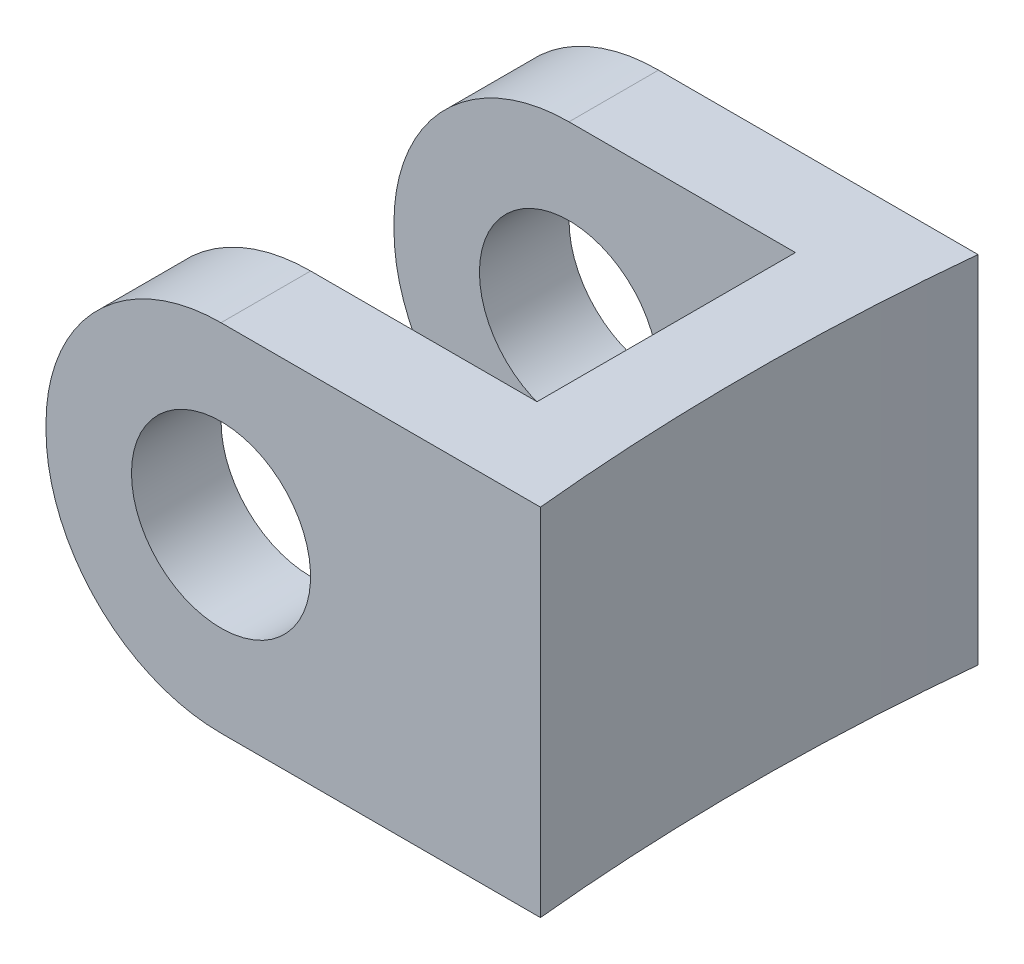
ISO-10303-21;
HEADER;
FILE_DESCRIPTION(('STEP AP214'),'2;1');
FILE_NAME('part.step','',(''),(''),'','','');
FILE_SCHEMA(('AUTOMOTIVE_DESIGN { 1 0 10303 214 1 1 1 1 }'));
ENDSEC;
DATA;
#1=APPLICATION_CONTEXT('core data for automotive mechanical design processes');
#2=APPLICATION_PROTOCOL_DEFINITION('international standard','automotive_design',2000,#1);
#3=PRODUCT_CONTEXT('',#1,'mechanical');
#4=PRODUCT('Part','Part','',(#3));
#5=PRODUCT_RELATED_PRODUCT_CATEGORY('part','',(#4));
#6=PRODUCT_DEFINITION_FORMATION('','',#4);
#7=PRODUCT_DEFINITION_CONTEXT('part definition',#1,'design');
#8=PRODUCT_DEFINITION('design','',#6,#7);
#9=PRODUCT_DEFINITION_SHAPE('','',#8);
#10=(LENGTH_UNIT() NAMED_UNIT(*) SI_UNIT(.MILLI.,.METRE.));
#11=(NAMED_UNIT(*) PLANE_ANGLE_UNIT() SI_UNIT($,.RADIAN.));
#12=(NAMED_UNIT(*) SI_UNIT($,.STERADIAN.) SOLID_ANGLE_UNIT());
#13=UNCERTAINTY_MEASURE_WITH_UNIT(LENGTH_MEASURE(1.E-05),#10,'distance_accuracy_value','');
#14=(GEOMETRIC_REPRESENTATION_CONTEXT(3) GLOBAL_UNCERTAINTY_ASSIGNED_CONTEXT((#13)) GLOBAL_UNIT_ASSIGNED_CONTEXT((#10,
#11,#12)) REPRESENTATION_CONTEXT('',''));
#15=CARTESIAN_POINT('',(0.,0.,0.));
#16=DIRECTION('',(0.,0.,1.));
#17=DIRECTION('',(1.,0.,0.));
#18=AXIS2_PLACEMENT_3D('',#15,#16,#17);
#19=CARTESIAN_POINT('',(0.,8.255,0.));
#20=DIRECTION('',(1.,0.,0.));
#21=DIRECTION('',(0.,0.,-1.));
#22=AXIS2_PLACEMENT_3D('',#19,#20,#21);
#23=PLANE('',#22);
#24=DIRECTION('',(0.,-1.,0.));
#25=VECTOR('',#24,1.);
#26=CARTESIAN_POINT('',(0.,8.255,0.));
#27=LINE('',#26,#25);
#28=CARTESIAN_POINT('',(0.,4.191,0.));
#29=VERTEX_POINT('',#28);
#30=CARTESIAN_POINT('',(0.,4.064,0.));
#31=VERTEX_POINT('',#30);
#32=EDGE_CURVE('E160',#29,#31,#27,.T.);
#33=ORIENTED_EDGE('',*,*,#32,.T.);
#34=DIRECTION('',(0.,0.,1.));
#35=VECTOR('',#34,1.);
#36=CARTESIAN_POINT('',(0.,4.064,0.));
#37=LINE('',#36,#35);
#38=CARTESIAN_POINT('',(0.,4.064,2.08026));
#39=VERTEX_POINT('',#38);
#40=EDGE_CURVE('E211',#31,#39,#37,.T.);
#41=ORIENTED_EDGE('',*,*,#40,.T.);
#42=DIRECTION('',(0.,-1.,0.));
#43=VECTOR('',#42,1.);
#44=CARTESIAN_POINT('',(0.,8.255,2.08026));
#45=LINE('',#44,#43);
#46=CARTESIAN_POINT('',(0.,4.191,2.08026));
#47=VERTEX_POINT('',#46);
#48=EDGE_CURVE('E143',#47,#39,#45,.T.);
#49=ORIENTED_EDGE('',*,*,#48,.F.);
#50=DIRECTION('',(0.,0.,1.));
#51=VECTOR('',#50,1.);
#52=CARTESIAN_POINT('',(0.,4.191,0.));
#53=LINE('',#52,#51);
#54=EDGE_CURVE('E53',#47,#29,#53,.F.);
#55=ORIENTED_EDGE('',*,*,#54,.T.);
#56=EDGE_LOOP('',(#33,#41,#49,#55));
#57=FACE_BOUND('',#56,.T.);
#58=ADVANCED_FACE('F33',(#57),#23,.F.);
#59=CARTESIAN_POINT('',(9.3218,8.255,2.08026));
#60=DIRECTION('',(0.,0.,-1.));
#61=DIRECTION('',(-1.,0.,0.));
#62=AXIS2_PLACEMENT_3D('',#59,#60,#61);
#63=PLANE('',#62);
#64=CARTESIAN_POINT('',(4.064,4.191,2.08026));
#65=DIRECTION('',(0.,0.,-1.));
#66=DIRECTION('',(-1.,0.,0.));
#67=AXIS2_PLACEMENT_3D('',#64,#65,#66);
#68=CIRCLE('',#67,2.07899);
#69=CARTESIAN_POINT('',(1.98501,4.191,2.08026));
#70=VERTEX_POINT('',#69);
#71=EDGE_CURVE('E163',#70,#70,#68,.T.);
#72=ORIENTED_EDGE('',*,*,#71,.T.);
#73=EDGE_LOOP('',(#72));
#74=FACE_BOUND('',#73,.T.);
#75=ORIENTED_EDGE('',*,*,#48,.T.);
#76=CARTESIAN_POINT('',(4.064,4.064,2.08026));
#77=DIRECTION('',(0.,0.,-1.));
#78=DIRECTION('',(-1.,0.,0.));
#79=AXIS2_PLACEMENT_3D('',#76,#77,#78);
#80=CIRCLE('',#79,4.064);
#81=CARTESIAN_POINT('',(4.064,0.,2.08026));
#82=VERTEX_POINT('',#81);
#83=EDGE_CURVE('E216',#39,#82,#80,.F.);
#84=ORIENTED_EDGE('',*,*,#83,.T.);
#85=DIRECTION('',(1.,0.,0.));
#86=VECTOR('',#85,1.);
#87=CARTESIAN_POINT('',(9.3218,0.,2.08026));
#88=LINE('',#87,#86);
#89=CARTESIAN_POINT('',(9.3218,0.,2.08026));
#90=VERTEX_POINT('',#89);
#91=EDGE_CURVE('E140',#82,#90,#88,.T.);
#92=ORIENTED_EDGE('',*,*,#91,.T.);
#93=DIRECTION('',(0.,-1.,0.));
#94=VECTOR('',#93,1.);
#95=CARTESIAN_POINT('',(9.3218,8.255,2.08026));
#96=LINE('',#95,#94);
#97=CARTESIAN_POINT('',(9.3218,8.255,2.08026));
#98=VERTEX_POINT('',#97);
#99=EDGE_CURVE('E136',#98,#90,#96,.T.);
#100=ORIENTED_EDGE('',*,*,#99,.F.);
#101=DIRECTION('',(1.,0.,0.));
#102=VECTOR('',#101,1.);
#103=CARTESIAN_POINT('',(9.3218,8.255,2.08026));
#104=LINE('',#103,#102);
#105=CARTESIAN_POINT('',(4.064,8.255,2.08026));
#106=VERTEX_POINT('',#105);
#107=EDGE_CURVE('E122',#106,#98,#104,.T.);
#108=ORIENTED_EDGE('',*,*,#107,.F.);
#109=CARTESIAN_POINT('',(4.064,4.191,2.08026));
#110=DIRECTION('',(0.,0.,-1.));
#111=DIRECTION('',(-1.,0.,0.));
#112=AXIS2_PLACEMENT_3D('',#109,#110,#111);
#113=CIRCLE('',#112,4.064);
#114=EDGE_CURVE('E214',#106,#47,#113,.F.);
#115=ORIENTED_EDGE('',*,*,#114,.T.);
#116=EDGE_LOOP('',(#75,#84,#92,#100,#108,#115));
#117=FACE_BOUND('',#116,.T.);
#118=ADVANCED_FACE('F138',(#74,#117),#63,.F.);
#119=CARTESIAN_POINT('',(9.3218,8.255,5.08));
#120=DIRECTION('',(1.,0.,0.));
#121=DIRECTION('',(0.,0.,-1.));
#122=AXIS2_PLACEMENT_3D('',#119,#120,#121);
#123=PLANE('',#122);
#124=DIRECTION('',(0.,0.,1.));
#125=VECTOR('',#124,1.);
#126=CARTESIAN_POINT('',(9.3218,0.,5.08));
#127=LINE('',#126,#125);
#128=CARTESIAN_POINT('',(9.3218,0.,8.07974));
#129=VERTEX_POINT('',#128);
#130=EDGE_CURVE('E162',#90,#129,#127,.T.);
#131=ORIENTED_EDGE('',*,*,#130,.T.);
#132=DIRECTION('',(0.,-1.,0.));
#133=VECTOR('',#132,1.);
#134=CARTESIAN_POINT('',(9.3218,8.255,8.07974));
#135=LINE('',#134,#133);
#136=CARTESIAN_POINT('',(9.3218,8.255,8.07974));
#137=VERTEX_POINT('',#136);
#138=EDGE_CURVE('E144',#137,#129,#135,.T.);
#139=ORIENTED_EDGE('',*,*,#138,.F.);
#140=DIRECTION('',(0.,0.,1.));
#141=VECTOR('',#140,1.);
#142=CARTESIAN_POINT('',(9.3218,8.255,5.08));
#143=LINE('',#142,#141);
#144=EDGE_CURVE('E127',#98,#137,#143,.T.);
#145=ORIENTED_EDGE('',*,*,#144,.F.);
#146=ORIENTED_EDGE('',*,*,#99,.T.);
#147=EDGE_LOOP('',(#131,#139,#145,#146));
#148=FACE_BOUND('',#147,.T.);
#149=ADVANCED_FACE('F146',(#148),#123,.F.);
#150=CARTESIAN_POINT('',(9.3218,8.255,8.07974));
#151=DIRECTION('',(0.,0.,1.));
#152=DIRECTION('',(1.,0.,0.));
#153=AXIS2_PLACEMENT_3D('',#150,#151,#152);
#154=PLANE('',#153);
#155=CARTESIAN_POINT('',(4.064,4.191,8.07974));
#156=DIRECTION('',(0.,0.,1.));
#157=DIRECTION('',(1.,0.,0.));
#158=AXIS2_PLACEMENT_3D('',#155,#156,#157);
#159=CIRCLE('',#158,2.07899);
#160=CARTESIAN_POINT('',(6.14299,4.191,8.07974));
#161=VERTEX_POINT('',#160);
#162=EDGE_CURVE('E400',#161,#161,#159,.T.);
#163=ORIENTED_EDGE('',*,*,#162,.T.);
#164=EDGE_LOOP('',(#163));
#165=FACE_BOUND('',#164,.T.);
#166=DIRECTION('',(-1.,0.,0.));
#167=VECTOR('',#166,1.);
#168=CARTESIAN_POINT('',(9.3218,0.,8.07974));
#169=LINE('',#168,#167);
#170=CARTESIAN_POINT('',(4.064,0.,8.07974));
#171=VERTEX_POINT('',#170);
#172=EDGE_CURVE('E165',#129,#171,#169,.T.);
#173=ORIENTED_EDGE('',*,*,#172,.T.);
#174=CARTESIAN_POINT('',(4.064,4.064,8.07974));
#175=DIRECTION('',(0.,0.,1.));
#176=DIRECTION('',(1.,0.,0.));
#177=AXIS2_PLACEMENT_3D('',#174,#175,#176);
#178=CIRCLE('',#177,4.064);
#179=CARTESIAN_POINT('',(0.,4.064,8.07974));
#180=VERTEX_POINT('',#179);
#181=EDGE_CURVE('E204',#171,#180,#178,.F.);
#182=ORIENTED_EDGE('',*,*,#181,.T.);
#183=DIRECTION('',(0.,-1.,0.));
#184=VECTOR('',#183,1.);
#185=CARTESIAN_POINT('',(0.,8.255,8.07974));
#186=LINE('',#185,#184);
#187=CARTESIAN_POINT('',(0.,4.191,8.07974));
#188=VERTEX_POINT('',#187);
#189=EDGE_CURVE('E184',#188,#180,#186,.T.);
#190=ORIENTED_EDGE('',*,*,#189,.F.);
#191=CARTESIAN_POINT('',(4.064,4.191,8.07974));
#192=DIRECTION('',(0.,0.,1.));
#193=DIRECTION('',(1.,0.,0.));
#194=AXIS2_PLACEMENT_3D('',#191,#192,#193);
#195=CIRCLE('',#194,4.064);
#196=CARTESIAN_POINT('',(4.064,8.255,8.07974));
#197=VERTEX_POINT('',#196);
#198=EDGE_CURVE('E202',#188,#197,#195,.F.);
#199=ORIENTED_EDGE('',*,*,#198,.T.);
#200=DIRECTION('',(-1.,0.,0.));
#201=VECTOR('',#200,1.);
#202=CARTESIAN_POINT('',(9.3218,8.255,8.07974));
#203=LINE('',#202,#201);
#204=EDGE_CURVE('E149',#137,#197,#203,.T.);
#205=ORIENTED_EDGE('',*,*,#204,.F.);
#206=ORIENTED_EDGE('',*,*,#138,.T.);
#207=EDGE_LOOP('',(#173,#182,#190,#199,#205,#206));
#208=FACE_BOUND('',#207,.T.);
#209=ADVANCED_FACE('F232',(#165,#208),#154,.F.);
#210=CARTESIAN_POINT('',(0.,8.255,8.07974));
#211=DIRECTION('',(1.,0.,0.));
#212=DIRECTION('',(0.,0.,-1.));
#213=AXIS2_PLACEMENT_3D('',#210,#211,#212);
#214=PLANE('',#213);
#215=ORIENTED_EDGE('',*,*,#189,.T.);
#216=DIRECTION('',(0.,0.,1.));
#217=VECTOR('',#216,1.);
#218=CARTESIAN_POINT('',(0.,4.064,8.07974));
#219=LINE('',#218,#217);
#220=CARTESIAN_POINT('',(0.,4.064,10.16));
#221=VERTEX_POINT('',#220);
#222=EDGE_CURVE('E191',#180,#221,#219,.T.);
#223=ORIENTED_EDGE('',*,*,#222,.T.);
#224=DIRECTION('',(0.,-1.,0.));
#225=VECTOR('',#224,1.);
#226=CARTESIAN_POINT('',(0.,8.255,10.16));
#227=LINE('',#226,#225);
#228=CARTESIAN_POINT('',(0.,4.191,10.16));
#229=VERTEX_POINT('',#228);
#230=EDGE_CURVE('E181',#229,#221,#227,.T.);
#231=ORIENTED_EDGE('',*,*,#230,.F.);
#232=DIRECTION('',(0.,0.,1.));
#233=VECTOR('',#232,1.);
#234=CARTESIAN_POINT('',(0.,4.191,8.07974));
#235=LINE('',#234,#233);
#236=EDGE_CURVE('E189',#229,#188,#235,.F.);
#237=ORIENTED_EDGE('',*,*,#236,.T.);
#238=EDGE_LOOP('',(#215,#223,#231,#237));
#239=FACE_BOUND('',#238,.T.);
#240=ADVANCED_FACE('F246',(#239),#214,.F.);
#241=CARTESIAN_POINT('',(11.2268,8.255,10.16));
#242=DIRECTION('',(0.,0.,-1.));
#243=DIRECTION('',(-1.,0.,0.));
#244=AXIS2_PLACEMENT_3D('',#241,#242,#243);
#245=PLANE('',#244);
#246=CARTESIAN_POINT('',(4.064,4.191,10.16));
#247=DIRECTION('',(0.,0.,-1.));
#248=DIRECTION('',(-1.,0.,0.));
#249=AXIS2_PLACEMENT_3D('',#246,#247,#248);
#250=CIRCLE('',#249,2.07899);
#251=CARTESIAN_POINT('',(1.98501,4.191,10.16));
#252=VERTEX_POINT('',#251);
#253=EDGE_CURVE('E402',#252,#252,#250,.T.);
#254=ORIENTED_EDGE('',*,*,#253,.T.);
#255=EDGE_LOOP('',(#254));
#256=FACE_BOUND('',#255,.T.);
#257=ORIENTED_EDGE('',*,*,#230,.T.);
#258=CARTESIAN_POINT('',(4.064,4.064,10.16));
#259=DIRECTION('',(0.,0.,-1.));
#260=DIRECTION('',(-1.,0.,0.));
#261=AXIS2_PLACEMENT_3D('',#258,#259,#260);
#262=CIRCLE('',#261,4.064);
#263=CARTESIAN_POINT('',(4.064,0.,10.16));
#264=VERTEX_POINT('',#263);
#265=EDGE_CURVE('E196',#221,#264,#262,.F.);
#266=ORIENTED_EDGE('',*,*,#265,.T.);
#267=DIRECTION('',(1.,0.,0.));
#268=VECTOR('',#267,1.);
#269=CARTESIAN_POINT('',(11.2268,0.,10.16));
#270=LINE('',#269,#268);
#271=CARTESIAN_POINT('',(11.4814381949837,0.,10.16));
#272=VERTEX_POINT('',#271);
#273=EDGE_CURVE('E168',#264,#272,#270,.T.);
#274=ORIENTED_EDGE('',*,*,#273,.T.);
#275=DIRECTION('',(0.,-1.,0.));
#276=VECTOR('',#275,1.);
#277=CARTESIAN_POINT('',(11.4814381949837,8.255,10.16));
#278=LINE('',#277,#276);
#279=CARTESIAN_POINT('',(11.4814381949837,8.255,10.16));
#280=VERTEX_POINT('',#279);
#281=EDGE_CURVE('E178',#280,#272,#278,.T.);
#282=ORIENTED_EDGE('',*,*,#281,.F.);
#283=DIRECTION('',(1.,0.,0.));
#284=VECTOR('',#283,1.);
#285=CARTESIAN_POINT('',(0.,8.255,10.16));
#286=LINE('',#285,#284);
#287=CARTESIAN_POINT('',(4.064,8.255,10.16));
#288=VERTEX_POINT('',#287);
#289=EDGE_CURVE('E151',#288,#280,#286,.T.);
#290=ORIENTED_EDGE('',*,*,#289,.F.);
#291=CARTESIAN_POINT('',(4.064,4.191,10.16));
#292=DIRECTION('',(0.,0.,-1.));
#293=DIRECTION('',(-1.,0.,0.));
#294=AXIS2_PLACEMENT_3D('',#291,#292,#293);
#295=CIRCLE('',#294,4.064);
#296=EDGE_CURVE('E194',#288,#229,#295,.F.);
#297=ORIENTED_EDGE('',*,*,#296,.T.);
#298=EDGE_LOOP('',(#257,#266,#274,#282,#290,#297));
#299=FACE_BOUND('',#298,.T.);
#300=ADVANCED_FACE('F243',(#256,#299),#245,.F.);
#301=CARTESIAN_POINT('',(62.0268,8.255,5.08));
#302=DIRECTION('',(0.,-1.,0.));
#303=DIRECTION('',(0.,0.,-1.));
#304=AXIS2_PLACEMENT_3D('',#301,#302,#303);
#305=CYLINDRICAL_SURFACE('',#304,50.8);
#306=CARTESIAN_POINT('',(62.0268,0.,5.08));
#307=DIRECTION('',(0.,-1.,0.));
#308=DIRECTION('',(0.,0.,1.));
#309=AXIS2_PLACEMENT_3D('',#306,#307,#308);
#310=CIRCLE('',#309,50.8);
#311=CARTESIAN_POINT('',(11.4814381949837,0.,0.));
#312=VERTEX_POINT('',#311);
#313=EDGE_CURVE('E170',#272,#312,#310,.T.);
#314=ORIENTED_EDGE('',*,*,#313,.T.);
#315=DIRECTION('',(0.,-1.,0.));
#316=VECTOR('',#315,1.);
#317=CARTESIAN_POINT('',(11.4814381949837,8.255,0.));
#318=LINE('',#317,#316);
#319=CARTESIAN_POINT('',(11.4814381949837,8.255,0.));
#320=VERTEX_POINT('',#319);
#321=EDGE_CURVE('E175',#320,#312,#318,.T.);
#322=ORIENTED_EDGE('',*,*,#321,.F.);
#323=CARTESIAN_POINT('',(62.0268,8.255,5.08));
#324=DIRECTION('',(0.,-1.,0.));
#325=DIRECTION('',(0.,0.,1.));
#326=AXIS2_PLACEMENT_3D('',#323,#324,#325);
#327=CIRCLE('',#326,50.8);
#328=EDGE_CURVE('E156',#280,#320,#327,.T.);
#329=ORIENTED_EDGE('',*,*,#328,.F.);
#330=ORIENTED_EDGE('',*,*,#281,.T.);
#331=EDGE_LOOP('',(#314,#322,#329,#330));
#332=FACE_BOUND('',#331,.T.);
#333=ADVANCED_FACE('F253',(#332),#305,.F.);
#334=CARTESIAN_POINT('',(0.,8.255,0.));
#335=DIRECTION('',(0.,0.,1.));
#336=DIRECTION('',(1.,0.,0.));
#337=AXIS2_PLACEMENT_3D('',#334,#335,#336);
#338=PLANE('',#337);
#339=CARTESIAN_POINT('',(4.064,4.191,0.));
#340=DIRECTION('',(0.,0.,-1.));
#341=DIRECTION('',(-1.,0.,0.));
#342=AXIS2_PLACEMENT_3D('',#339,#340,#341);
#343=CIRCLE('',#342,2.07899);
#344=CARTESIAN_POINT('',(1.98501,4.191,0.));
#345=VERTEX_POINT('',#344);
#346=EDGE_CURVE('E406',#345,#345,#343,.T.);
#347=ORIENTED_EDGE('',*,*,#346,.F.);
#348=EDGE_LOOP('',(#347));
#349=FACE_BOUND('',#348,.T.);
#350=DIRECTION('',(-1.,0.,0.));
#351=VECTOR('',#350,1.);
#352=CARTESIAN_POINT('',(0.,0.,0.));
#353=LINE('',#352,#351);
#354=CARTESIAN_POINT('',(4.064,0.,0.));
#355=VERTEX_POINT('',#354);
#356=EDGE_CURVE('E133',#312,#355,#353,.T.);
#357=ORIENTED_EDGE('',*,*,#356,.T.);
#358=CARTESIAN_POINT('',(4.064,4.064,0.));
#359=DIRECTION('',(0.,0.,1.));
#360=DIRECTION('',(1.,0.,0.));
#361=AXIS2_PLACEMENT_3D('',#358,#359,#360);
#362=CIRCLE('',#361,4.064);
#363=EDGE_CURVE('E11',#355,#31,#362,.F.);
#364=ORIENTED_EDGE('',*,*,#363,.T.);
#365=ORIENTED_EDGE('',*,*,#32,.F.);
#366=CARTESIAN_POINT('',(4.064,4.191,0.));
#367=DIRECTION('',(0.,0.,1.));
#368=DIRECTION('',(1.,0.,0.));
#369=AXIS2_PLACEMENT_3D('',#366,#367,#368);
#370=CIRCLE('',#369,4.064);
#371=CARTESIAN_POINT('',(4.064,8.255,0.));
#372=VERTEX_POINT('',#371);
#373=EDGE_CURVE('E41',#29,#372,#370,.F.);
#374=ORIENTED_EDGE('',*,*,#373,.T.);
#375=DIRECTION('',(-1.,0.,0.));
#376=VECTOR('',#375,1.);
#377=CARTESIAN_POINT('',(11.2268,8.255,0.));
#378=LINE('',#377,#376);
#379=EDGE_CURVE('E158',#320,#372,#378,.T.);
#380=ORIENTED_EDGE('',*,*,#379,.F.);
#381=ORIENTED_EDGE('',*,*,#321,.T.);
#382=EDGE_LOOP('',(#357,#364,#365,#374,#380,#381));
#383=FACE_BOUND('',#382,.T.);
#384=ADVANCED_FACE('F219',(#349,#383),#338,.F.);
#385=CARTESIAN_POINT('',(62.0268,8.255,5.08));
#386=DIRECTION('',(0.,1.,0.));
#387=DIRECTION('',(0.,0.,1.));
#388=AXIS2_PLACEMENT_3D('',#385,#386,#387);
#389=PLANE('',#388);
#390=ORIENTED_EDGE('',*,*,#204,.T.);
#391=DIRECTION('',(0.,0.,1.));
#392=VECTOR('',#391,1.);
#393=CARTESIAN_POINT('',(4.064,8.255,10.16));
#394=LINE('',#393,#392);
#395=EDGE_CURVE('E207',#197,#288,#394,.T.);
#396=ORIENTED_EDGE('',*,*,#395,.T.);
#397=ORIENTED_EDGE('',*,*,#289,.T.);
#398=ORIENTED_EDGE('',*,*,#328,.T.);
#399=ORIENTED_EDGE('',*,*,#379,.T.);
#400=DIRECTION('',(0.,0.,1.));
#401=VECTOR('',#400,1.);
#402=CARTESIAN_POINT('',(4.064,8.255,2.08026));
#403=LINE('',#402,#401);
#404=EDGE_CURVE('E131',#372,#106,#403,.T.);
#405=ORIENTED_EDGE('',*,*,#404,.T.);
#406=ORIENTED_EDGE('',*,*,#107,.T.);
#407=ORIENTED_EDGE('',*,*,#144,.T.);
#408=EDGE_LOOP('',(#390,#396,#397,#398,#399,#405,#406,#407));
#409=FACE_BOUND('',#408,.T.);
#410=ADVANCED_FACE('F125',(#409),#389,.T.);
#411=CARTESIAN_POINT('',(62.0268,0.,5.08));
#412=DIRECTION('',(0.,1.,0.));
#413=DIRECTION('',(0.,0.,1.));
#414=AXIS2_PLACEMENT_3D('',#411,#412,#413);
#415=PLANE('',#414);
#416=ORIENTED_EDGE('',*,*,#273,.F.);
#417=DIRECTION('',(0.,0.,1.));
#418=VECTOR('',#417,1.);
#419=CARTESIAN_POINT('',(4.064,0.,5.08000000000001));
#420=LINE('',#419,#418);
#421=EDGE_CURVE('E200',#264,#171,#420,.F.);
#422=ORIENTED_EDGE('',*,*,#421,.T.);
#423=ORIENTED_EDGE('',*,*,#172,.F.);
#424=ORIENTED_EDGE('',*,*,#130,.F.);
#425=ORIENTED_EDGE('',*,*,#91,.F.);
#426=DIRECTION('',(0.,0.,1.));
#427=VECTOR('',#426,1.);
#428=CARTESIAN_POINT('',(4.064,0.,5.08));
#429=LINE('',#428,#427);
#430=EDGE_CURVE('E198',#82,#355,#429,.F.);
#431=ORIENTED_EDGE('',*,*,#430,.T.);
#432=ORIENTED_EDGE('',*,*,#356,.F.);
#433=ORIENTED_EDGE('',*,*,#313,.F.);
#434=EDGE_LOOP('',(#416,#422,#423,#424,#425,#431,#432,#433));
#435=FACE_BOUND('',#434,.T.);
#436=ADVANCED_FACE('F229',(#435),#415,.F.);
#437=CARTESIAN_POINT('',(4.064,4.064,8.07974));
#438=DIRECTION('',(0.,0.,1.));
#439=DIRECTION('',(1.,0.,0.));
#440=AXIS2_PLACEMENT_3D('',#437,#438,#439);
#441=CYLINDRICAL_SURFACE('',#440,4.064);
#442=ORIENTED_EDGE('',*,*,#181,.F.);
#443=ORIENTED_EDGE('',*,*,#421,.F.);
#444=ORIENTED_EDGE('',*,*,#265,.F.);
#445=ORIENTED_EDGE('',*,*,#222,.F.);
#446=EDGE_LOOP('',(#442,#443,#444,#445));
#447=FACE_BOUND('',#446,.T.);
#448=ADVANCED_FACE('F249',(#447),#441,.T.);
#449=CARTESIAN_POINT('',(4.064,4.191,5.08000000000001));
#450=DIRECTION('',(0.,0.,-1.));
#451=DIRECTION('',(-1.,0.,0.));
#452=AXIS2_PLACEMENT_3D('',#449,#450,#451);
#453=CYLINDRICAL_SURFACE('',#452,4.064);
#454=ORIENTED_EDGE('',*,*,#198,.F.);
#455=ORIENTED_EDGE('',*,*,#236,.F.);
#456=ORIENTED_EDGE('',*,*,#296,.F.);
#457=ORIENTED_EDGE('',*,*,#395,.F.);
#458=EDGE_LOOP('',(#454,#455,#456,#457));
#459=FACE_BOUND('',#458,.T.);
#460=ADVANCED_FACE('F239',(#459),#453,.T.);
#461=CARTESIAN_POINT('',(4.064,4.064,0.));
#462=DIRECTION('',(0.,0.,1.));
#463=DIRECTION('',(1.,0.,0.));
#464=AXIS2_PLACEMENT_3D('',#461,#462,#463);
#465=CYLINDRICAL_SURFACE('',#464,4.064);
#466=ORIENTED_EDGE('',*,*,#363,.F.);
#467=ORIENTED_EDGE('',*,*,#430,.F.);
#468=ORIENTED_EDGE('',*,*,#83,.F.);
#469=ORIENTED_EDGE('',*,*,#40,.F.);
#470=EDGE_LOOP('',(#466,#467,#468,#469));
#471=FACE_BOUND('',#470,.T.);
#472=ADVANCED_FACE('F225',(#471),#465,.T.);
#473=CARTESIAN_POINT('',(4.064,4.191,5.08));
#474=DIRECTION('',(0.,0.,-1.));
#475=DIRECTION('',(-1.,0.,0.));
#476=AXIS2_PLACEMENT_3D('',#473,#474,#475);
#477=CYLINDRICAL_SURFACE('',#476,4.064);
#478=ORIENTED_EDGE('',*,*,#373,.F.);
#479=ORIENTED_EDGE('',*,*,#54,.F.);
#480=ORIENTED_EDGE('',*,*,#114,.F.);
#481=ORIENTED_EDGE('',*,*,#404,.F.);
#482=EDGE_LOOP('',(#478,#479,#480,#481));
#483=FACE_BOUND('',#482,.T.);
#484=ADVANCED_FACE('F35',(#483),#477,.T.);
#485=CARTESIAN_POINT('',(4.064,4.191,10.16));
#486=DIRECTION('',(0.,0.,-1.));
#487=DIRECTION('',(-1.,0.,0.));
#488=AXIS2_PLACEMENT_3D('',#485,#486,#487);
#489=CYLINDRICAL_SURFACE('',#488,2.07899);
#490=ORIENTED_EDGE('',*,*,#346,.T.);
#491=EDGE_LOOP('',(#490));
#492=FACE_BOUND('',#491,.T.);
#493=ORIENTED_EDGE('',*,*,#71,.F.);
#494=EDGE_LOOP('',(#493));
#495=FACE_BOUND('',#494,.T.);
#496=ADVANCED_FACE('F280',(#492,#495),#489,.F.);
#497=ORIENTED_EDGE('',*,*,#253,.F.);
#498=EDGE_LOOP('',(#497));
#499=FACE_BOUND('',#498,.T.);
#500=ORIENTED_EDGE('',*,*,#162,.F.);
#501=EDGE_LOOP('',(#500));
#502=FACE_BOUND('',#501,.T.);
#503=ADVANCED_FACE('F284',(#499,#502),#489,.F.);
#504=CLOSED_SHELL('',(#58,#118,#149,#209,#240,#300,#333,#384,#410,#436,#448,#460,#472,#484,#496,#503));
#505=MANIFOLD_SOLID_BREP('B2',#504);
#506=ADVANCED_BREP_SHAPE_REPRESENTATION('',(#18,#505),#14);
#507=SHAPE_DEFINITION_REPRESENTATION(#9,#506);
ENDSEC;
END-ISO-10303-21;
